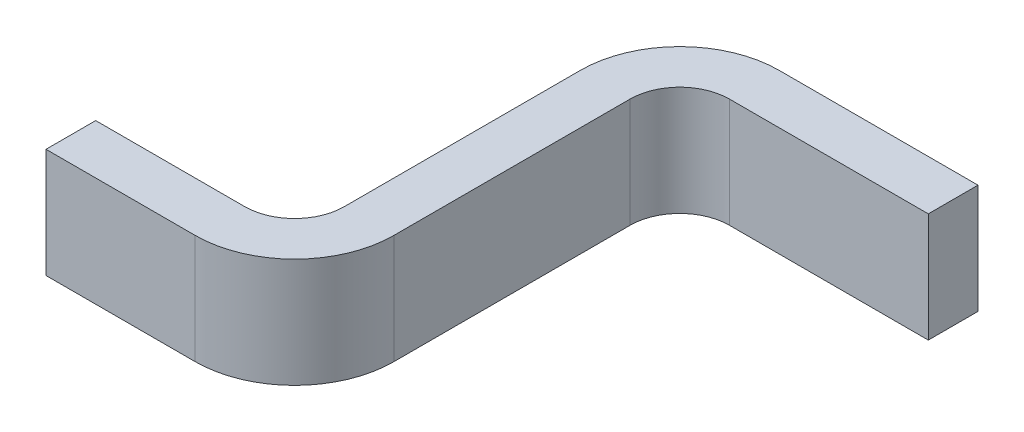
ISO-10303-21;
HEADER;
FILE_DESCRIPTION(('STEP AP214'),'2;1');
FILE_NAME('part.step','',(''),(''),'','','');
FILE_SCHEMA(('AUTOMOTIVE_DESIGN { 1 0 10303 214 1 1 1 1 }'));
ENDSEC;
DATA;
#1=APPLICATION_CONTEXT('core data for automotive mechanical design processes');
#2=APPLICATION_PROTOCOL_DEFINITION('international standard','automotive_design',2000,#1);
#3=PRODUCT_CONTEXT('',#1,'mechanical');
#4=PRODUCT('Part','Part','',(#3));
#5=PRODUCT_RELATED_PRODUCT_CATEGORY('part','',(#4));
#6=PRODUCT_DEFINITION_FORMATION('','',#4);
#7=PRODUCT_DEFINITION_CONTEXT('part definition',#1,'design');
#8=PRODUCT_DEFINITION('design','',#6,#7);
#9=PRODUCT_DEFINITION_SHAPE('','',#8);
#10=(LENGTH_UNIT() NAMED_UNIT(*) SI_UNIT(.MILLI.,.METRE.));
#11=(NAMED_UNIT(*) PLANE_ANGLE_UNIT() SI_UNIT($,.RADIAN.));
#12=(NAMED_UNIT(*) SI_UNIT($,.STERADIAN.) SOLID_ANGLE_UNIT());
#13=UNCERTAINTY_MEASURE_WITH_UNIT(LENGTH_MEASURE(1.E-05),#10,'distance_accuracy_value','');
#14=(GEOMETRIC_REPRESENTATION_CONTEXT(3) GLOBAL_UNCERTAINTY_ASSIGNED_CONTEXT((#13)) GLOBAL_UNIT_ASSIGNED_CONTEXT((#10,
#11,#12)) REPRESENTATION_CONTEXT('',''));
#15=CARTESIAN_POINT('',(0.,0.,0.));
#16=DIRECTION('',(0.,0.,1.));
#17=DIRECTION('',(1.,0.,0.));
#18=AXIS2_PLACEMENT_3D('',#15,#16,#17);
#19=CARTESIAN_POINT('',(3.9,-2.14,0.675));
#20=DIRECTION('',(0.,-1.,0.));
#21=DIRECTION('',(0.,0.,-1.));
#22=AXIS2_PLACEMENT_3D('',#19,#20,#21);
#23=PLANE('',#22);
#24=CARTESIAN_POINT('',(3.8,-2.14,0.675));
#25=DIRECTION('',(0.,-1.,0.));
#26=DIRECTION('',(0.,0.,-1.));
#27=AXIS2_PLACEMENT_3D('',#24,#25,#26);
#28=CIRCLE('',#27,0.1);
#29=CARTESIAN_POINT('',(3.9,-2.14,0.675));
#30=VERTEX_POINT('',#29);
#31=CARTESIAN_POINT('',(3.8,-2.14,0.775));
#32=VERTEX_POINT('',#31);
#33=EDGE_CURVE('E162',#30,#32,#28,.T.);
#34=ORIENTED_EDGE('',*,*,#33,.T.);
#35=DIRECTION('',(1.,0.,0.));
#36=VECTOR('',#35,1.);
#37=CARTESIAN_POINT('',(3.5,-2.14,0.775));
#38=LINE('',#37,#36);
#39=CARTESIAN_POINT('',(3.5,-2.14,0.775));
#40=VERTEX_POINT('',#39);
#41=EDGE_CURVE('E120',#32,#40,#38,.F.);
#42=ORIENTED_EDGE('',*,*,#41,.T.);
#43=DIRECTION('',(0.,0.,1.));
#44=VECTOR('',#43,1.);
#45=CARTESIAN_POINT('',(3.5,-2.14,0.775));
#46=LINE('',#45,#44);
#47=CARTESIAN_POINT('',(3.5,-2.14,0.875));
#48=VERTEX_POINT('',#47);
#49=EDGE_CURVE('E116',#48,#40,#46,.F.);
#50=ORIENTED_EDGE('',*,*,#49,.F.);
#51=DIRECTION('',(-1.,0.,0.));
#52=VECTOR('',#51,1.);
#53=CARTESIAN_POINT('',(3.5,-2.14,0.875));
#54=LINE('',#53,#52);
#55=CARTESIAN_POINT('',(3.8,-2.14,0.875));
#56=VERTEX_POINT('',#55);
#57=EDGE_CURVE('E111',#48,#56,#54,.F.);
#58=ORIENTED_EDGE('',*,*,#57,.T.);
#59=CARTESIAN_POINT('',(3.8,-2.14,0.675));
#60=DIRECTION('',(0.,-1.,0.));
#61=DIRECTION('',(0.,0.,-1.));
#62=AXIS2_PLACEMENT_3D('',#59,#60,#61);
#63=CIRCLE('',#62,0.2);
#64=CARTESIAN_POINT('',(4.,-2.14,0.675));
#65=VERTEX_POINT('',#64);
#66=EDGE_CURVE('E102',#65,#56,#63,.T.);
#67=ORIENTED_EDGE('',*,*,#66,.F.);
#68=DIRECTION('',(0.,0.,1.));
#69=VECTOR('',#68,1.);
#70=CARTESIAN_POINT('',(4.,-2.14,0.675));
#71=LINE('',#70,#69);
#72=CARTESIAN_POINT('',(4.,-2.14,0.2));
#73=VERTEX_POINT('',#72);
#74=EDGE_CURVE('E98',#65,#73,#71,.F.);
#75=ORIENTED_EDGE('',*,*,#74,.T.);
#76=CARTESIAN_POINT('',(4.1,-2.14,0.2));
#77=DIRECTION('',(0.,1.,0.));
#78=DIRECTION('',(0.,0.,1.));
#79=AXIS2_PLACEMENT_3D('',#76,#77,#78);
#80=CIRCLE('',#79,0.1);
#81=CARTESIAN_POINT('',(4.1,-2.14,0.1));
#82=VERTEX_POINT('',#81);
#83=EDGE_CURVE('E20',#73,#82,#80,.F.);
#84=ORIENTED_EDGE('',*,*,#83,.T.);
#85=DIRECTION('',(-1.,0.,0.));
#86=VECTOR('',#85,1.);
#87=CARTESIAN_POINT('',(4.1,-2.14,0.1));
#88=LINE('',#87,#86);
#89=CARTESIAN_POINT('',(4.5,-2.14,0.1));
#90=VERTEX_POINT('',#89);
#91=EDGE_CURVE('E145',#82,#90,#88,.F.);
#92=ORIENTED_EDGE('',*,*,#91,.T.);
#93=DIRECTION('',(0.,0.,1.));
#94=VECTOR('',#93,1.);
#95=CARTESIAN_POINT('',(4.5,-2.14,0.));
#96=LINE('',#95,#94);
#97=CARTESIAN_POINT('',(4.5,-2.14,0.));
#98=VERTEX_POINT('',#97);
#99=EDGE_CURVE('E139',#90,#98,#96,.F.);
#100=ORIENTED_EDGE('',*,*,#99,.T.);
#101=DIRECTION('',(1.,0.,0.));
#102=VECTOR('',#101,1.);
#103=CARTESIAN_POINT('',(4.1,-2.14,0.));
#104=LINE('',#103,#102);
#105=CARTESIAN_POINT('',(4.1,-2.14,0.));
#106=VERTEX_POINT('',#105);
#107=EDGE_CURVE('E132',#98,#106,#104,.F.);
#108=ORIENTED_EDGE('',*,*,#107,.T.);
#109=CARTESIAN_POINT('',(4.1,-2.14,0.2));
#110=DIRECTION('',(0.,1.,0.));
#111=DIRECTION('',(0.,0.,1.));
#112=AXIS2_PLACEMENT_3D('',#109,#110,#111);
#113=CIRCLE('',#112,0.2);
#114=CARTESIAN_POINT('',(3.9,-2.14,0.2));
#115=VERTEX_POINT('',#114);
#116=EDGE_CURVE('E135',#115,#106,#113,.F.);
#117=ORIENTED_EDGE('',*,*,#116,.F.);
#118=DIRECTION('',(0.,0.,-1.));
#119=VECTOR('',#118,1.);
#120=CARTESIAN_POINT('',(3.9,-2.14,0.675));
#121=LINE('',#120,#119);
#122=EDGE_CURVE('E128',#115,#30,#121,.F.);
#123=ORIENTED_EDGE('',*,*,#122,.T.);
#124=EDGE_LOOP('',(#34,#42,#50,#58,#67,#75,#84,#92,#100,#108,#117,#123));
#125=FACE_BOUND('',#124,.T.);
#126=ADVANCED_FACE('F17',(#125),#23,.F.);
#127=CARTESIAN_POINT('',(4.1,-2.14,0.2));
#128=DIRECTION('',(0.,1.,0.));
#129=DIRECTION('',(0.,0.,1.));
#130=AXIS2_PLACEMENT_3D('',#127,#128,#129);
#131=CYLINDRICAL_SURFACE('',#130,0.1);
#132=DIRECTION('',(0.,1.,0.));
#133=VECTOR('',#132,1.);
#134=CARTESIAN_POINT('',(4.,-2.14,0.2));
#135=LINE('',#134,#133);
#136=CARTESIAN_POINT('',(4.,-2.36,0.2));
#137=VERTEX_POINT('',#136);
#138=EDGE_CURVE('E91',#73,#137,#135,.F.);
#139=ORIENTED_EDGE('',*,*,#138,.T.);
#140=CARTESIAN_POINT('',(4.1,-2.36,0.2));
#141=DIRECTION('',(0.,1.,0.));
#142=DIRECTION('',(0.,0.,1.));
#143=AXIS2_PLACEMENT_3D('',#140,#141,#142);
#144=CIRCLE('',#143,0.1);
#145=CARTESIAN_POINT('',(4.1,-2.36,0.1));
#146=VERTEX_POINT('',#145);
#147=EDGE_CURVE('E103',#137,#146,#144,.F.);
#148=ORIENTED_EDGE('',*,*,#147,.T.);
#149=DIRECTION('',(0.,1.,0.));
#150=VECTOR('',#149,1.);
#151=CARTESIAN_POINT('',(4.1,-2.14,0.1));
#152=LINE('',#151,#150);
#153=EDGE_CURVE('E92',#146,#82,#152,.T.);
#154=ORIENTED_EDGE('',*,*,#153,.T.);
#155=ORIENTED_EDGE('',*,*,#83,.F.);
#156=EDGE_LOOP('',(#139,#148,#154,#155));
#157=FACE_BOUND('',#156,.T.);
#158=ADVANCED_FACE('F89',(#157),#131,.F.);
#159=CARTESIAN_POINT('',(4.1,-2.14,0.1));
#160=DIRECTION('',(0.,0.,-1.));
#161=DIRECTION('',(-1.,0.,0.));
#162=AXIS2_PLACEMENT_3D('',#159,#160,#161);
#163=PLANE('',#162);
#164=ORIENTED_EDGE('',*,*,#153,.F.);
#165=DIRECTION('',(1.,0.,0.));
#166=VECTOR('',#165,1.);
#167=CARTESIAN_POINT('',(4.,-2.36,0.1));
#168=LINE('',#167,#166);
#169=CARTESIAN_POINT('',(4.5,-2.36,0.1));
#170=VERTEX_POINT('',#169);
#171=EDGE_CURVE('E105',#146,#170,#168,.T.);
#172=ORIENTED_EDGE('',*,*,#171,.T.);
#173=DIRECTION('',(0.,1.,0.));
#174=VECTOR('',#173,1.);
#175=CARTESIAN_POINT('',(4.5,-2.36,0.1));
#176=LINE('',#175,#174);
#177=EDGE_CURVE('E142',#170,#90,#176,.T.);
#178=ORIENTED_EDGE('',*,*,#177,.T.);
#179=ORIENTED_EDGE('',*,*,#91,.F.);
#180=EDGE_LOOP('',(#164,#172,#178,#179));
#181=FACE_BOUND('',#180,.T.);
#182=ADVANCED_FACE('F187',(#181),#163,.F.);
#183=CARTESIAN_POINT('',(4.5,-2.36,0.));
#184=DIRECTION('',(-1.,0.,0.));
#185=DIRECTION('',(0.,0.,1.));
#186=AXIS2_PLACEMENT_3D('',#183,#184,#185);
#187=PLANE('',#186);
#188=ORIENTED_EDGE('',*,*,#177,.F.);
#189=DIRECTION('',(0.,0.,1.));
#190=VECTOR('',#189,1.);
#191=CARTESIAN_POINT('',(4.5,-2.36,0.675));
#192=LINE('',#191,#190);
#193=CARTESIAN_POINT('',(4.5,-2.36,0.));
#194=VERTEX_POINT('',#193);
#195=EDGE_CURVE('E176',#170,#194,#192,.F.);
#196=ORIENTED_EDGE('',*,*,#195,.T.);
#197=DIRECTION('',(0.,1.,0.));
#198=VECTOR('',#197,1.);
#199=CARTESIAN_POINT('',(4.5,-2.36,0.));
#200=LINE('',#199,#198);
#201=EDGE_CURVE('E136',#194,#98,#200,.T.);
#202=ORIENTED_EDGE('',*,*,#201,.T.);
#203=ORIENTED_EDGE('',*,*,#99,.F.);
#204=EDGE_LOOP('',(#188,#196,#202,#203));
#205=FACE_BOUND('',#204,.T.);
#206=ADVANCED_FACE('F192',(#205),#187,.F.);
#207=CARTESIAN_POINT('',(4.1,-2.36,0.));
#208=DIRECTION('',(0.,0.,1.));
#209=DIRECTION('',(1.,0.,0.));
#210=AXIS2_PLACEMENT_3D('',#207,#208,#209);
#211=PLANE('',#210);
#212=DIRECTION('',(0.,1.,0.));
#213=VECTOR('',#212,1.);
#214=CARTESIAN_POINT('',(4.1,-2.36,0.));
#215=LINE('',#214,#213);
#216=CARTESIAN_POINT('',(4.1,-2.36,0.));
#217=VERTEX_POINT('',#216);
#218=EDGE_CURVE('E163',#106,#217,#215,.F.);
#219=ORIENTED_EDGE('',*,*,#218,.F.);
#220=ORIENTED_EDGE('',*,*,#107,.F.);
#221=ORIENTED_EDGE('',*,*,#201,.F.);
#222=DIRECTION('',(1.,0.,0.));
#223=VECTOR('',#222,1.);
#224=CARTESIAN_POINT('',(4.,-2.36,0.));
#225=LINE('',#224,#223);
#226=EDGE_CURVE('E159',#194,#217,#225,.F.);
#227=ORIENTED_EDGE('',*,*,#226,.T.);
#228=EDGE_LOOP('',(#219,#220,#221,#227));
#229=FACE_BOUND('',#228,.T.);
#230=ADVANCED_FACE('F264',(#229),#211,.F.);
#231=CARTESIAN_POINT('',(4.1,-2.36,0.2));
#232=DIRECTION('',(0.,1.,0.));
#233=DIRECTION('',(0.,0.,1.));
#234=AXIS2_PLACEMENT_3D('',#231,#232,#233);
#235=CYLINDRICAL_SURFACE('',#234,0.2);
#236=ORIENTED_EDGE('',*,*,#116,.T.);
#237=ORIENTED_EDGE('',*,*,#218,.T.);
#238=CARTESIAN_POINT('',(4.1,-2.36,0.2));
#239=DIRECTION('',(0.,1.,0.));
#240=DIRECTION('',(0.,0.,1.));
#241=AXIS2_PLACEMENT_3D('',#238,#239,#240);
#242=CIRCLE('',#241,0.2);
#243=CARTESIAN_POINT('',(3.9,-2.36,0.2));
#244=VERTEX_POINT('',#243);
#245=EDGE_CURVE('E157',#217,#244,#242,.T.);
#246=ORIENTED_EDGE('',*,*,#245,.T.);
#247=DIRECTION('',(0.,1.,0.));
#248=VECTOR('',#247,1.);
#249=CARTESIAN_POINT('',(3.9,-2.36,0.2));
#250=LINE('',#249,#248);
#251=EDGE_CURVE('E131',#244,#115,#250,.T.);
#252=ORIENTED_EDGE('',*,*,#251,.T.);
#253=EDGE_LOOP('',(#236,#237,#246,#252));
#254=FACE_BOUND('',#253,.T.);
#255=ADVANCED_FACE('F266',(#254),#235,.T.);
#256=CARTESIAN_POINT('',(3.9,-2.36,0.675));
#257=DIRECTION('',(1.,0.,0.));
#258=DIRECTION('',(0.,0.,-1.));
#259=AXIS2_PLACEMENT_3D('',#256,#257,#258);
#260=PLANE('',#259);
#261=DIRECTION('',(0.,-1.,0.));
#262=VECTOR('',#261,1.);
#263=CARTESIAN_POINT('',(3.9,-2.36,0.675));
#264=LINE('',#263,#262);
#265=CARTESIAN_POINT('',(3.9,-2.36,0.675));
#266=VERTEX_POINT('',#265);
#267=EDGE_CURVE('E130',#266,#30,#264,.F.);
#268=ORIENTED_EDGE('',*,*,#267,.T.);
#269=ORIENTED_EDGE('',*,*,#122,.F.);
#270=ORIENTED_EDGE('',*,*,#251,.F.);
#271=DIRECTION('',(0.,0.,1.));
#272=VECTOR('',#271,1.);
#273=CARTESIAN_POINT('',(3.9,-2.36,0.675));
#274=LINE('',#273,#272);
#275=EDGE_CURVE('E156',#244,#266,#274,.T.);
#276=ORIENTED_EDGE('',*,*,#275,.T.);
#277=EDGE_LOOP('',(#268,#269,#270,#276));
#278=FACE_BOUND('',#277,.T.);
#279=ADVANCED_FACE('F231',(#278),#260,.F.);
#280=CARTESIAN_POINT('',(3.8,-2.36,0.675));
#281=DIRECTION('',(0.,-1.,0.));
#282=DIRECTION('',(0.,0.,-1.));
#283=AXIS2_PLACEMENT_3D('',#280,#281,#282);
#284=CYLINDRICAL_SURFACE('',#283,0.1);
#285=DIRECTION('',(0.,1.,0.));
#286=VECTOR('',#285,1.);
#287=CARTESIAN_POINT('',(3.8,-2.36,0.775));
#288=LINE('',#287,#286);
#289=CARTESIAN_POINT('',(3.8,-2.36,0.775));
#290=VERTEX_POINT('',#289);
#291=EDGE_CURVE('E125',#290,#32,#288,.T.);
#292=ORIENTED_EDGE('',*,*,#291,.T.);
#293=ORIENTED_EDGE('',*,*,#33,.F.);
#294=ORIENTED_EDGE('',*,*,#267,.F.);
#295=CARTESIAN_POINT('',(3.8,-2.36,0.675));
#296=DIRECTION('',(0.,-1.,0.));
#297=DIRECTION('',(0.,0.,-1.));
#298=AXIS2_PLACEMENT_3D('',#295,#296,#297);
#299=CIRCLE('',#298,0.1);
#300=EDGE_CURVE('E152',#266,#290,#299,.T.);
#301=ORIENTED_EDGE('',*,*,#300,.T.);
#302=EDGE_LOOP('',(#292,#293,#294,#301));
#303=FACE_BOUND('',#302,.T.);
#304=ADVANCED_FACE('F235',(#303),#284,.F.);
#305=CARTESIAN_POINT('',(3.5,-2.36,0.775));
#306=DIRECTION('',(0.,0.,1.));
#307=DIRECTION('',(1.,0.,0.));
#308=AXIS2_PLACEMENT_3D('',#305,#306,#307);
#309=PLANE('',#308);
#310=DIRECTION('',(0.,1.,0.));
#311=VECTOR('',#310,1.);
#312=CARTESIAN_POINT('',(3.5,-2.36,0.775));
#313=LINE('',#312,#311);
#314=CARTESIAN_POINT('',(3.5,-2.36,0.775));
#315=VERTEX_POINT('',#314);
#316=EDGE_CURVE('E119',#40,#315,#313,.F.);
#317=ORIENTED_EDGE('',*,*,#316,.F.);
#318=ORIENTED_EDGE('',*,*,#41,.F.);
#319=ORIENTED_EDGE('',*,*,#291,.F.);
#320=DIRECTION('',(1.,0.,0.));
#321=VECTOR('',#320,1.);
#322=CARTESIAN_POINT('',(4.,-2.36,0.775));
#323=LINE('',#322,#321);
#324=EDGE_CURVE('E155',#290,#315,#323,.F.);
#325=ORIENTED_EDGE('',*,*,#324,.T.);
#326=EDGE_LOOP('',(#317,#318,#319,#325));
#327=FACE_BOUND('',#326,.T.);
#328=ADVANCED_FACE('F259',(#327),#309,.F.);
#329=CARTESIAN_POINT('',(3.5,-2.36,0.775));
#330=DIRECTION('',(-1.,0.,0.));
#331=DIRECTION('',(0.,0.,1.));
#332=AXIS2_PLACEMENT_3D('',#329,#330,#331);
#333=PLANE('',#332);
#334=DIRECTION('',(0.,0.,1.));
#335=VECTOR('',#334,1.);
#336=CARTESIAN_POINT('',(3.5,-2.36,0.675));
#337=LINE('',#336,#335);
#338=CARTESIAN_POINT('',(3.5,-2.36,0.875));
#339=VERTEX_POINT('',#338);
#340=EDGE_CURVE('E217',#315,#339,#337,.T.);
#341=ORIENTED_EDGE('',*,*,#340,.T.);
#342=DIRECTION('',(0.,1.,0.));
#343=VECTOR('',#342,1.);
#344=CARTESIAN_POINT('',(3.5,-2.14,0.875));
#345=LINE('',#344,#343);
#346=EDGE_CURVE('E113',#339,#48,#345,.T.);
#347=ORIENTED_EDGE('',*,*,#346,.T.);
#348=ORIENTED_EDGE('',*,*,#49,.T.);
#349=ORIENTED_EDGE('',*,*,#316,.T.);
#350=EDGE_LOOP('',(#341,#347,#348,#349));
#351=FACE_BOUND('',#350,.T.);
#352=ADVANCED_FACE('F255',(#351),#333,.T.);
#353=CARTESIAN_POINT('',(3.5,-2.14,0.875));
#354=DIRECTION('',(0.,0.,-1.));
#355=DIRECTION('',(-1.,0.,0.));
#356=AXIS2_PLACEMENT_3D('',#353,#354,#355);
#357=PLANE('',#356);
#358=ORIENTED_EDGE('',*,*,#346,.F.);
#359=DIRECTION('',(1.,0.,0.));
#360=VECTOR('',#359,1.);
#361=CARTESIAN_POINT('',(4.,-2.36,0.875));
#362=LINE('',#361,#360);
#363=CARTESIAN_POINT('',(3.8,-2.36,0.875));
#364=VERTEX_POINT('',#363);
#365=EDGE_CURVE('E151',#339,#364,#362,.T.);
#366=ORIENTED_EDGE('',*,*,#365,.T.);
#367=DIRECTION('',(0.,-1.,0.));
#368=VECTOR('',#367,1.);
#369=CARTESIAN_POINT('',(3.8,-2.14,0.875));
#370=LINE('',#369,#368);
#371=EDGE_CURVE('E99',#56,#364,#370,.T.);
#372=ORIENTED_EDGE('',*,*,#371,.F.);
#373=ORIENTED_EDGE('',*,*,#57,.F.);
#374=EDGE_LOOP('',(#358,#366,#372,#373));
#375=FACE_BOUND('',#374,.T.);
#376=ADVANCED_FACE('F251',(#375),#357,.F.);
#377=CARTESIAN_POINT('',(3.8,-2.14,0.675));
#378=DIRECTION('',(0.,-1.,0.));
#379=DIRECTION('',(0.,0.,-1.));
#380=AXIS2_PLACEMENT_3D('',#377,#378,#379);
#381=CYLINDRICAL_SURFACE('',#380,0.2);
#382=CARTESIAN_POINT('',(3.8,-2.36,0.675));
#383=DIRECTION('',(0.,-1.,0.));
#384=DIRECTION('',(0.,0.,-1.));
#385=AXIS2_PLACEMENT_3D('',#382,#383,#384);
#386=CIRCLE('',#385,0.2);
#387=CARTESIAN_POINT('',(4.,-2.36,0.675));
#388=VERTEX_POINT('',#387);
#389=EDGE_CURVE('E26',#364,#388,#386,.F.);
#390=ORIENTED_EDGE('',*,*,#389,.T.);
#391=DIRECTION('',(0.,1.,0.));
#392=VECTOR('',#391,1.);
#393=CARTESIAN_POINT('',(4.,-2.14,0.675));
#394=LINE('',#393,#392);
#395=EDGE_CURVE('E34',#388,#65,#394,.T.);
#396=ORIENTED_EDGE('',*,*,#395,.T.);
#397=ORIENTED_EDGE('',*,*,#66,.T.);
#398=ORIENTED_EDGE('',*,*,#371,.T.);
#399=EDGE_LOOP('',(#390,#396,#397,#398));
#400=FACE_BOUND('',#399,.T.);
#401=ADVANCED_FACE('F280',(#400),#381,.T.);
#402=CARTESIAN_POINT('',(4.,-2.14,0.675));
#403=DIRECTION('',(-1.,0.,0.));
#404=DIRECTION('',(0.,0.,1.));
#405=AXIS2_PLACEMENT_3D('',#402,#403,#404);
#406=PLANE('',#405);
#407=ORIENTED_EDGE('',*,*,#395,.F.);
#408=DIRECTION('',(0.,0.,1.));
#409=VECTOR('',#408,1.);
#410=CARTESIAN_POINT('',(4.,-2.36,0.675));
#411=LINE('',#410,#409);
#412=EDGE_CURVE('E11',#388,#137,#411,.F.);
#413=ORIENTED_EDGE('',*,*,#412,.T.);
#414=ORIENTED_EDGE('',*,*,#138,.F.);
#415=ORIENTED_EDGE('',*,*,#74,.F.);
#416=EDGE_LOOP('',(#407,#413,#414,#415));
#417=FACE_BOUND('',#416,.T.);
#418=ADVANCED_FACE('F97',(#417),#406,.F.);
#419=CARTESIAN_POINT('',(4.,-2.36,0.675));
#420=DIRECTION('',(0.,1.,0.));
#421=DIRECTION('',(0.,0.,1.));
#422=AXIS2_PLACEMENT_3D('',#419,#420,#421);
#423=PLANE('',#422);
#424=ORIENTED_EDGE('',*,*,#389,.F.);
#425=ORIENTED_EDGE('',*,*,#365,.F.);
#426=ORIENTED_EDGE('',*,*,#340,.F.);
#427=ORIENTED_EDGE('',*,*,#324,.F.);
#428=ORIENTED_EDGE('',*,*,#300,.F.);
#429=ORIENTED_EDGE('',*,*,#275,.F.);
#430=ORIENTED_EDGE('',*,*,#245,.F.);
#431=ORIENTED_EDGE('',*,*,#226,.F.);
#432=ORIENTED_EDGE('',*,*,#195,.F.);
#433=ORIENTED_EDGE('',*,*,#171,.F.);
#434=ORIENTED_EDGE('',*,*,#147,.F.);
#435=ORIENTED_EDGE('',*,*,#412,.F.);
#436=EDGE_LOOP('',(#424,#425,#426,#427,#428,#429,#430,#431,#432,#433,#434,#435));
#437=FACE_BOUND('',#436,.T.);
#438=ADVANCED_FACE('F197',(#437),#423,.F.);
#439=CLOSED_SHELL('',(#126,#158,#182,#206,#230,#255,#279,#304,#328,#352,#376,#401,#418,#438));
#440=MANIFOLD_SOLID_BREP('B1',#439);
#441=ADVANCED_BREP_SHAPE_REPRESENTATION('',(#18,#440),#14);
#442=SHAPE_DEFINITION_REPRESENTATION(#9,#441);
ENDSEC;
END-ISO-10303-21;
